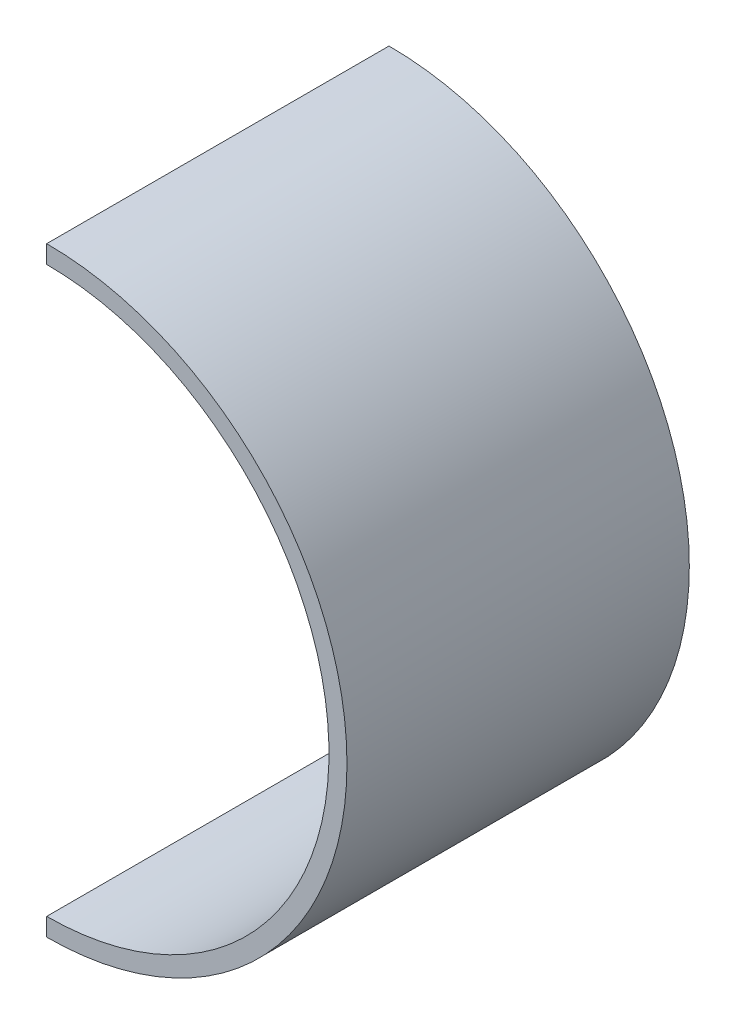
ISO-10303-21;
HEADER;
FILE_DESCRIPTION(('STEP AP214'),'2;1');
FILE_NAME('part.step','',(''),(''),'','','');
FILE_SCHEMA(('AUTOMOTIVE_DESIGN { 1 0 10303 214 1 1 1 1 }'));
ENDSEC;
DATA;
#1=APPLICATION_CONTEXT('core data for automotive mechanical design processes');
#2=APPLICATION_PROTOCOL_DEFINITION('international standard','automotive_design',2000,#1);
#3=PRODUCT_CONTEXT('',#1,'mechanical');
#4=PRODUCT('Part','Part','',(#3));
#5=PRODUCT_RELATED_PRODUCT_CATEGORY('part','',(#4));
#6=PRODUCT_DEFINITION_FORMATION('','',#4);
#7=PRODUCT_DEFINITION_CONTEXT('part definition',#1,'design');
#8=PRODUCT_DEFINITION('design','',#6,#7);
#9=PRODUCT_DEFINITION_SHAPE('','',#8);
#10=(LENGTH_UNIT() NAMED_UNIT(*) SI_UNIT(.MILLI.,.METRE.));
#11=(NAMED_UNIT(*) PLANE_ANGLE_UNIT() SI_UNIT($,.RADIAN.));
#12=(NAMED_UNIT(*) SI_UNIT($,.STERADIAN.) SOLID_ANGLE_UNIT());
#13=UNCERTAINTY_MEASURE_WITH_UNIT(LENGTH_MEASURE(1.E-05),#10,'distance_accuracy_value','');
#14=(GEOMETRIC_REPRESENTATION_CONTEXT(3) GLOBAL_UNCERTAINTY_ASSIGNED_CONTEXT((#13)) GLOBAL_UNIT_ASSIGNED_CONTEXT((#10,
#11,#12)) REPRESENTATION_CONTEXT('',''));
#15=CARTESIAN_POINT('',(0.,0.,0.));
#16=DIRECTION('',(0.,0.,1.));
#17=DIRECTION('',(1.,0.,0.));
#18=AXIS2_PLACEMENT_3D('',#15,#16,#17);
#19=CARTESIAN_POINT('',(0.,0.,3.));
#20=DIRECTION('',(0.,0.,1.));
#21=DIRECTION('',(1.,0.,0.));
#22=AXIS2_PLACEMENT_3D('',#19,#20,#21);
#23=PLANE('',#22);
#24=DIRECTION('',(0.,1.,0.));
#25=VECTOR('',#24,1.);
#26=CARTESIAN_POINT('',(300.,1.71683972880179E-13,3.));
#27=LINE('',#26,#25);
#28=CARTESIAN_POINT('',(300.,47.,3.));
#29=VERTEX_POINT('',#28);
#30=CARTESIAN_POINT('',(300.,50.,3.));
#31=VERTEX_POINT('',#30);
#32=EDGE_CURVE('E40',#29,#31,#27,.T.);
#33=ORIENTED_EDGE('',*,*,#32,.T.);
#34=CARTESIAN_POINT('',(300.,0.,3.));
#35=DIRECTION('',(0.,0.,1.));
#36=DIRECTION('',(1.,0.,0.));
#37=AXIS2_PLACEMENT_3D('',#34,#35,#36);
#38=CIRCLE('',#37,50.);
#39=CARTESIAN_POINT('',(300.,-50.,3.));
#40=VERTEX_POINT('',#39);
#41=EDGE_CURVE('E87',#40,#31,#38,.T.);
#42=ORIENTED_EDGE('',*,*,#41,.F.);
#43=DIRECTION('',(0.,1.,0.));
#44=VECTOR('',#43,1.);
#45=CARTESIAN_POINT('',(300.,1.71683972880179E-13,3.));
#46=LINE('',#45,#44);
#47=CARTESIAN_POINT('',(300.,-47.,3.));
#48=VERTEX_POINT('',#47);
#49=EDGE_CURVE('E11',#40,#48,#46,.T.);
#50=ORIENTED_EDGE('',*,*,#49,.T.);
#51=CARTESIAN_POINT('',(300.,0.,3.));
#52=DIRECTION('',(0.,0.,1.));
#53=DIRECTION('',(1.,0.,0.));
#54=AXIS2_PLACEMENT_3D('',#51,#52,#53);
#55=CIRCLE('',#54,47.);
#56=EDGE_CURVE('E35',#29,#48,#55,.F.);
#57=ORIENTED_EDGE('',*,*,#56,.F.);
#58=EDGE_LOOP('',(#33,#42,#50,#57));
#59=FACE_BOUND('',#58,.T.);
#60=ADVANCED_FACE('F32',(#59),#23,.F.);
#61=CARTESIAN_POINT('',(-300.,0.,60.));
#62=DIRECTION('',(0.,0.,1.));
#63=DIRECTION('',(1.,0.,0.));
#64=AXIS2_PLACEMENT_3D('',#61,#62,#63);
#65=PLANE('',#64);
#66=CARTESIAN_POINT('',(300.,0.,60.));
#67=DIRECTION('',(0.,0.,1.));
#68=DIRECTION('',(1.,0.,0.));
#69=AXIS2_PLACEMENT_3D('',#66,#67,#68);
#70=CIRCLE('',#69,50.);
#71=CARTESIAN_POINT('',(300.,-50.,60.));
#72=VERTEX_POINT('',#71);
#73=CARTESIAN_POINT('',(300.,50.,60.));
#74=VERTEX_POINT('',#73);
#75=EDGE_CURVE('E91',#72,#74,#70,.T.);
#76=ORIENTED_EDGE('',*,*,#75,.T.);
#77=DIRECTION('',(0.,-1.,0.));
#78=VECTOR('',#77,1.);
#79=CARTESIAN_POINT('',(300.,3.43367945760358E-13,60.));
#80=LINE('',#79,#78);
#81=CARTESIAN_POINT('',(300.,47.,60.));
#82=VERTEX_POINT('',#81);
#83=EDGE_CURVE('E75',#74,#82,#80,.T.);
#84=ORIENTED_EDGE('',*,*,#83,.T.);
#85=CARTESIAN_POINT('',(300.,0.,60.));
#86=DIRECTION('',(0.,0.,1.));
#87=DIRECTION('',(1.,0.,0.));
#88=AXIS2_PLACEMENT_3D('',#85,#86,#87);
#89=CIRCLE('',#88,47.);
#90=CARTESIAN_POINT('',(300.,-47.,60.));
#91=VERTEX_POINT('',#90);
#92=EDGE_CURVE('E80',#91,#82,#89,.T.);
#93=ORIENTED_EDGE('',*,*,#92,.F.);
#94=EDGE_CURVE('E92',#91,#72,#80,.T.);
#95=ORIENTED_EDGE('',*,*,#94,.T.);
#96=EDGE_LOOP('',(#76,#84,#93,#95));
#97=FACE_BOUND('',#96,.T.);
#98=ADVANCED_FACE('F89',(#97),#65,.T.);
#99=CARTESIAN_POINT('',(300.,1.71683972880179E-13,0.));
#100=DIRECTION('',(-1.,0.,0.));
#101=DIRECTION('',(0.,-1.,0.));
#102=AXIS2_PLACEMENT_3D('',#99,#100,#101);
#103=PLANE('',#102);
#104=ORIENTED_EDGE('',*,*,#32,.F.);
#105=DIRECTION('',(0.,0.,1.));
#106=VECTOR('',#105,1.);
#107=CARTESIAN_POINT('',(300.,47.,3.));
#108=LINE('',#107,#106);
#109=EDGE_CURVE('E70',#29,#82,#108,.T.);
#110=ORIENTED_EDGE('',*,*,#109,.T.);
#111=ORIENTED_EDGE('',*,*,#83,.F.);
#112=DIRECTION('',(0.,0.,-1.));
#113=VECTOR('',#112,1.);
#114=CARTESIAN_POINT('',(300.,50.,60.));
#115=LINE('',#114,#113);
#116=EDGE_CURVE('E77',#74,#31,#115,.T.);
#117=ORIENTED_EDGE('',*,*,#116,.T.);
#118=EDGE_LOOP('',(#104,#110,#111,#117));
#119=FACE_BOUND('',#118,.T.);
#120=ADVANCED_FACE('F72',(#119),#103,.T.);
#121=ORIENTED_EDGE('',*,*,#49,.F.);
#122=DIRECTION('',(0.,0.,-1.));
#123=VECTOR('',#122,1.);
#124=CARTESIAN_POINT('',(300.,-50.,60.));
#125=LINE('',#124,#123);
#126=EDGE_CURVE('E94',#72,#40,#125,.T.);
#127=ORIENTED_EDGE('',*,*,#126,.F.);
#128=ORIENTED_EDGE('',*,*,#94,.F.);
#129=DIRECTION('',(0.,0.,1.));
#130=VECTOR('',#129,1.);
#131=CARTESIAN_POINT('',(300.,-47.,3.));
#132=LINE('',#131,#130);
#133=EDGE_CURVE('E83',#48,#91,#132,.T.);
#134=ORIENTED_EDGE('',*,*,#133,.F.);
#135=EDGE_LOOP('',(#121,#127,#128,#134));
#136=FACE_BOUND('',#135,.T.);
#137=ADVANCED_FACE('F105',(#136),#103,.T.);
#138=CARTESIAN_POINT('',(300.,0.,60.));
#139=DIRECTION('',(0.,0.,-1.));
#140=DIRECTION('',(-1.,0.,0.));
#141=AXIS2_PLACEMENT_3D('',#138,#139,#140);
#142=CYLINDRICAL_SURFACE('',#141,50.);
#143=ORIENTED_EDGE('',*,*,#126,.T.);
#144=ORIENTED_EDGE('',*,*,#41,.T.);
#145=ORIENTED_EDGE('',*,*,#116,.F.);
#146=ORIENTED_EDGE('',*,*,#75,.F.);
#147=EDGE_LOOP('',(#143,#144,#145,#146));
#148=FACE_BOUND('',#147,.T.);
#149=ADVANCED_FACE('F100',(#148),#142,.T.);
#150=CARTESIAN_POINT('',(300.,0.,3.));
#151=DIRECTION('',(0.,0.,1.));
#152=DIRECTION('',(1.,0.,0.));
#153=AXIS2_PLACEMENT_3D('',#150,#151,#152);
#154=CYLINDRICAL_SURFACE('',#153,47.);
#155=ORIENTED_EDGE('',*,*,#109,.F.);
#156=ORIENTED_EDGE('',*,*,#56,.T.);
#157=ORIENTED_EDGE('',*,*,#133,.T.);
#158=ORIENTED_EDGE('',*,*,#92,.T.);
#159=EDGE_LOOP('',(#155,#156,#157,#158));
#160=FACE_BOUND('',#159,.T.);
#161=ADVANCED_FACE('F81',(#160),#154,.F.);
#162=CLOSED_SHELL('',(#60,#98,#120,#137,#149,#161));
#163=MANIFOLD_SOLID_BREP('B2',#162);
#164=ADVANCED_BREP_SHAPE_REPRESENTATION('',(#18,#163),#14);
#165=SHAPE_DEFINITION_REPRESENTATION(#9,#164);
ENDSEC;
END-ISO-10303-21;
